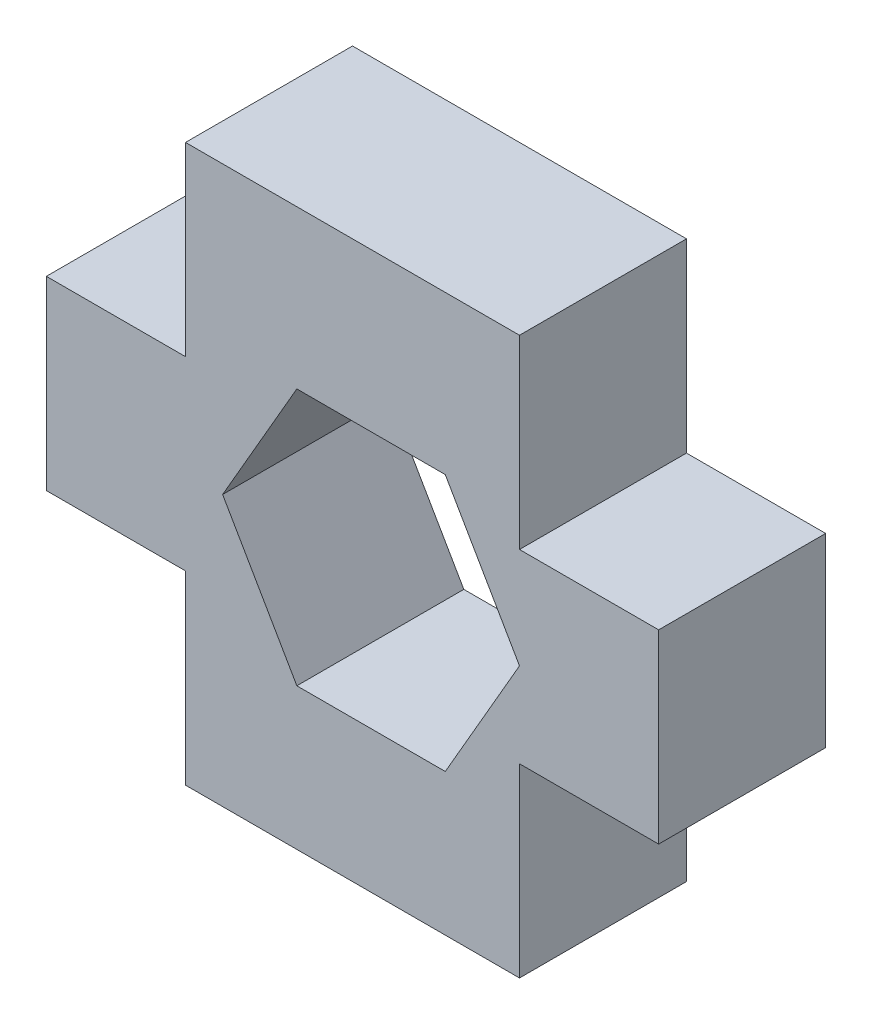
ISO-10303-21;
HEADER;
FILE_DESCRIPTION(('STEP AP214'),'2;1');
FILE_NAME('part.step','',(''),(''),'','','');
FILE_SCHEMA(('AUTOMOTIVE_DESIGN { 1 0 10303 214 1 1 1 1 }'));
ENDSEC;
DATA;
#1=APPLICATION_CONTEXT('core data for automotive mechanical design processes');
#2=APPLICATION_PROTOCOL_DEFINITION('international standard','automotive_design',2000,#1);
#3=PRODUCT_CONTEXT('',#1,'mechanical');
#4=PRODUCT('Part','Part','',(#3));
#5=PRODUCT_RELATED_PRODUCT_CATEGORY('part','',(#4));
#6=PRODUCT_DEFINITION_FORMATION('','',#4);
#7=PRODUCT_DEFINITION_CONTEXT('part definition',#1,'design');
#8=PRODUCT_DEFINITION('design','',#6,#7);
#9=PRODUCT_DEFINITION_SHAPE('','',#8);
#10=(LENGTH_UNIT() NAMED_UNIT(*) SI_UNIT(.MILLI.,.METRE.));
#11=(NAMED_UNIT(*) PLANE_ANGLE_UNIT() SI_UNIT($,.RADIAN.));
#12=(NAMED_UNIT(*) SI_UNIT($,.STERADIAN.) SOLID_ANGLE_UNIT());
#13=UNCERTAINTY_MEASURE_WITH_UNIT(LENGTH_MEASURE(1.E-05),#10,'distance_accuracy_value','');
#14=(GEOMETRIC_REPRESENTATION_CONTEXT(3) GLOBAL_UNCERTAINTY_ASSIGNED_CONTEXT((#13)) GLOBAL_UNIT_ASSIGNED_CONTEXT((#10,
#11,#12)) REPRESENTATION_CONTEXT('',''));
#15=CARTESIAN_POINT('',(0.,0.,0.));
#16=DIRECTION('',(0.,0.,1.));
#17=DIRECTION('',(1.,0.,0.));
#18=AXIS2_PLACEMENT_3D('',#15,#16,#17);
#19=CARTESIAN_POINT('',(0.,0.,3.6));
#20=DIRECTION('',(0.,0.,1.));
#21=DIRECTION('',(1.,0.,0.));
#22=AXIS2_PLACEMENT_3D('',#19,#20,#21);
#23=PLANE('',#22);
#24=DIRECTION('',(0.,-1.,0.));
#25=VECTOR('',#24,1.);
#26=CARTESIAN_POINT('',(0.,4.,3.6));
#27=LINE('',#26,#25);
#28=CARTESIAN_POINT('',(0.,4.,3.6));
#29=VERTEX_POINT('',#28);
#30=CARTESIAN_POINT('',(0.,0.,3.6));
#31=VERTEX_POINT('',#30);
#32=EDGE_CURVE('E208',#29,#31,#27,.T.);
#33=ORIENTED_EDGE('',*,*,#32,.T.);
#34=DIRECTION('',(1.,0.,0.));
#35=VECTOR('',#34,1.);
#36=CARTESIAN_POINT('',(0.,0.,3.6));
#37=LINE('',#36,#35);
#38=CARTESIAN_POINT('',(7.2,0.,3.6));
#39=VERTEX_POINT('',#38);
#40=EDGE_CURVE('E211',#31,#39,#37,.T.);
#41=ORIENTED_EDGE('',*,*,#40,.T.);
#42=DIRECTION('',(0.,1.,0.));
#43=VECTOR('',#42,1.);
#44=CARTESIAN_POINT('',(7.2,0.,3.6));
#45=LINE('',#44,#43);
#46=CARTESIAN_POINT('',(7.2,4.,3.6));
#47=VERTEX_POINT('',#46);
#48=EDGE_CURVE('E214',#39,#47,#45,.T.);
#49=ORIENTED_EDGE('',*,*,#48,.T.);
#50=DIRECTION('',(1.,0.,0.));
#51=VECTOR('',#50,1.);
#52=CARTESIAN_POINT('',(7.2,4.,3.6));
#53=LINE('',#52,#51);
#54=CARTESIAN_POINT('',(10.2,4.,3.6));
#55=VERTEX_POINT('',#54);
#56=EDGE_CURVE('E216',#47,#55,#53,.T.);
#57=ORIENTED_EDGE('',*,*,#56,.T.);
#58=DIRECTION('',(0.,1.,0.));
#59=VECTOR('',#58,1.);
#60=CARTESIAN_POINT('',(10.2,4.,3.6));
#61=LINE('',#60,#59);
#62=CARTESIAN_POINT('',(10.2,8.,3.6));
#63=VERTEX_POINT('',#62);
#64=EDGE_CURVE('E218',#55,#63,#61,.T.);
#65=ORIENTED_EDGE('',*,*,#64,.T.);
#66=DIRECTION('',(-1.,0.,0.));
#67=VECTOR('',#66,1.);
#68=CARTESIAN_POINT('',(7.2,8.,3.6));
#69=LINE('',#68,#67);
#70=CARTESIAN_POINT('',(7.2,8.,3.6));
#71=VERTEX_POINT('',#70);
#72=EDGE_CURVE('E220',#63,#71,#69,.T.);
#73=ORIENTED_EDGE('',*,*,#72,.T.);
#74=DIRECTION('',(0.,1.,0.));
#75=VECTOR('',#74,1.);
#76=CARTESIAN_POINT('',(7.2,8.,3.6));
#77=LINE('',#76,#75);
#78=CARTESIAN_POINT('',(7.2,12.,3.6));
#79=VERTEX_POINT('',#78);
#80=EDGE_CURVE('E222',#71,#79,#77,.T.);
#81=ORIENTED_EDGE('',*,*,#80,.T.);
#82=DIRECTION('',(-1.,0.,0.));
#83=VECTOR('',#82,1.);
#84=CARTESIAN_POINT('',(7.2,12.,3.6));
#85=LINE('',#84,#83);
#86=CARTESIAN_POINT('',(0.,12.,3.6));
#87=VERTEX_POINT('',#86);
#88=EDGE_CURVE('E224',#79,#87,#85,.T.);
#89=ORIENTED_EDGE('',*,*,#88,.T.);
#90=DIRECTION('',(0.,-1.,0.));
#91=VECTOR('',#90,1.);
#92=CARTESIAN_POINT('',(0.,12.,3.6));
#93=LINE('',#92,#91);
#94=CARTESIAN_POINT('',(0.,8.,3.6));
#95=VERTEX_POINT('',#94);
#96=EDGE_CURVE('E226',#87,#95,#93,.T.);
#97=ORIENTED_EDGE('',*,*,#96,.T.);
#98=DIRECTION('',(-1.,0.,0.));
#99=VECTOR('',#98,1.);
#100=CARTESIAN_POINT('',(0.,8.,3.6));
#101=LINE('',#100,#99);
#102=CARTESIAN_POINT('',(-3.,8.,3.6));
#103=VERTEX_POINT('',#102);
#104=EDGE_CURVE('E228',#95,#103,#101,.T.);
#105=ORIENTED_EDGE('',*,*,#104,.T.);
#106=DIRECTION('',(0.,-1.,0.));
#107=VECTOR('',#106,1.);
#108=CARTESIAN_POINT('',(-3.,8.,3.6));
#109=LINE('',#108,#107);
#110=CARTESIAN_POINT('',(-3.,4.,3.6));
#111=VERTEX_POINT('',#110);
#112=EDGE_CURVE('E230',#103,#111,#109,.T.);
#113=ORIENTED_EDGE('',*,*,#112,.T.);
#114=DIRECTION('',(1.,0.,0.));
#115=VECTOR('',#114,1.);
#116=CARTESIAN_POINT('',(-3.,4.,3.6));
#117=LINE('',#116,#115);
#118=EDGE_CURVE('E232',#111,#29,#117,.T.);
#119=ORIENTED_EDGE('',*,*,#118,.T.);
#120=EDGE_LOOP('',(#33,#41,#49,#57,#65,#73,#81,#89,#97,#105,#113,#119));
#121=FACE_BOUND('',#120,.T.);
#122=DIRECTION('',(-0.499999999999999,0.86602540378444,0.));
#123=VECTOR('',#122,1.);
#124=CARTESIAN_POINT('',(7.2,5.82679491924311,3.6));
#125=LINE('',#124,#123);
#126=CARTESIAN_POINT('',(7.2,5.82679491924311,3.6));
#127=VERTEX_POINT('',#126);
#128=CARTESIAN_POINT('',(5.6,8.59807621135332,3.6));
#129=VERTEX_POINT('',#128);
#130=EDGE_CURVE('E165',#127,#129,#125,.T.);
#131=ORIENTED_EDGE('',*,*,#130,.F.);
#132=DIRECTION('',(0.499999999999999,0.866025403784439,0.));
#133=VECTOR('',#132,1.);
#134=CARTESIAN_POINT('',(5.6,3.0555136271329,3.6));
#135=LINE('',#134,#133);
#136=CARTESIAN_POINT('',(5.6,3.0555136271329,3.6));
#137=VERTEX_POINT('',#136);
#138=EDGE_CURVE('E157',#137,#127,#135,.T.);
#139=ORIENTED_EDGE('',*,*,#138,.F.);
#140=DIRECTION('',(1.,0.,0.));
#141=VECTOR('',#140,1.);
#142=CARTESIAN_POINT('',(2.4,3.0555136271329,3.6));
#143=LINE('',#142,#141);
#144=CARTESIAN_POINT('',(2.4,3.0555136271329,3.6));
#145=VERTEX_POINT('',#144);
#146=EDGE_CURVE('E186',#145,#137,#143,.T.);
#147=ORIENTED_EDGE('',*,*,#146,.F.);
#148=DIRECTION('',(0.499999999999999,-0.866025403784439,0.));
#149=VECTOR('',#148,1.);
#150=CARTESIAN_POINT('',(0.800000000000002,5.82679491924311,3.6));
#151=LINE('',#150,#149);
#152=CARTESIAN_POINT('',(0.800000000000002,5.82679491924311,3.6));
#153=VERTEX_POINT('',#152);
#154=EDGE_CURVE('E184',#153,#145,#151,.T.);
#155=ORIENTED_EDGE('',*,*,#154,.F.);
#156=DIRECTION('',(-0.499999999999999,-0.866025403784439,0.));
#157=VECTOR('',#156,1.);
#158=CARTESIAN_POINT('',(2.4,8.59807621135331,3.6));
#159=LINE('',#158,#157);
#160=CARTESIAN_POINT('',(2.4,8.59807621135331,3.6));
#161=VERTEX_POINT('',#160);
#162=EDGE_CURVE('E180',#161,#153,#159,.T.);
#163=ORIENTED_EDGE('',*,*,#162,.F.);
#164=DIRECTION('',(-1.,0.,0.));
#165=VECTOR('',#164,1.);
#166=CARTESIAN_POINT('',(5.6,8.59807621135332,3.6));
#167=LINE('',#166,#165);
#168=EDGE_CURVE('E178',#129,#161,#167,.T.);
#169=ORIENTED_EDGE('',*,*,#168,.F.);
#170=EDGE_LOOP('',(#131,#139,#147,#155,#163,#169));
#171=FACE_BOUND('',#170,.T.);
#172=ADVANCED_FACE('F32',(#121,#171),#23,.T.);
#173=CARTESIAN_POINT('',(0.,0.,0.));
#174=DIRECTION('',(0.,0.,1.));
#175=DIRECTION('',(1.,0.,0.));
#176=AXIS2_PLACEMENT_3D('',#173,#174,#175);
#177=PLANE('',#176);
#178=DIRECTION('',(0.,-1.,0.));
#179=VECTOR('',#178,1.);
#180=CARTESIAN_POINT('',(0.,4.,0.));
#181=LINE('',#180,#179);
#182=CARTESIAN_POINT('',(0.,4.,0.));
#183=VERTEX_POINT('',#182);
#184=CARTESIAN_POINT('',(0.,0.,0.));
#185=VERTEX_POINT('',#184);
#186=EDGE_CURVE('E173',#183,#185,#181,.T.);
#187=ORIENTED_EDGE('',*,*,#186,.F.);
#188=DIRECTION('',(1.,0.,0.));
#189=VECTOR('',#188,1.);
#190=CARTESIAN_POINT('',(-3.,4.,0.));
#191=LINE('',#190,#189);
#192=CARTESIAN_POINT('',(-3.,4.,0.));
#193=VERTEX_POINT('',#192);
#194=EDGE_CURVE('E212',#193,#183,#191,.T.);
#195=ORIENTED_EDGE('',*,*,#194,.F.);
#196=DIRECTION('',(0.,-1.,0.));
#197=VECTOR('',#196,1.);
#198=CARTESIAN_POINT('',(-3.,8.,0.));
#199=LINE('',#198,#197);
#200=CARTESIAN_POINT('',(-3.,8.,0.));
#201=VERTEX_POINT('',#200);
#202=EDGE_CURVE('E255',#201,#193,#199,.T.);
#203=ORIENTED_EDGE('',*,*,#202,.F.);
#204=DIRECTION('',(-1.,0.,0.));
#205=VECTOR('',#204,1.);
#206=CARTESIAN_POINT('',(0.,8.,0.));
#207=LINE('',#206,#205);
#208=CARTESIAN_POINT('',(0.,8.,0.));
#209=VERTEX_POINT('',#208);
#210=EDGE_CURVE('E253',#209,#201,#207,.T.);
#211=ORIENTED_EDGE('',*,*,#210,.F.);
#212=DIRECTION('',(0.,-1.,0.));
#213=VECTOR('',#212,1.);
#214=CARTESIAN_POINT('',(0.,12.,0.));
#215=LINE('',#214,#213);
#216=CARTESIAN_POINT('',(0.,12.,0.));
#217=VERTEX_POINT('',#216);
#218=EDGE_CURVE('E251',#217,#209,#215,.T.);
#219=ORIENTED_EDGE('',*,*,#218,.F.);
#220=DIRECTION('',(-1.,0.,0.));
#221=VECTOR('',#220,1.);
#222=CARTESIAN_POINT('',(7.2,12.,0.));
#223=LINE('',#222,#221);
#224=CARTESIAN_POINT('',(7.2,12.,0.));
#225=VERTEX_POINT('',#224);
#226=EDGE_CURVE('E249',#225,#217,#223,.T.);
#227=ORIENTED_EDGE('',*,*,#226,.F.);
#228=DIRECTION('',(0.,1.,0.));
#229=VECTOR('',#228,1.);
#230=CARTESIAN_POINT('',(7.2,8.,0.));
#231=LINE('',#230,#229);
#232=CARTESIAN_POINT('',(7.2,8.,0.));
#233=VERTEX_POINT('',#232);
#234=EDGE_CURVE('E247',#233,#225,#231,.T.);
#235=ORIENTED_EDGE('',*,*,#234,.F.);
#236=DIRECTION('',(-1.,0.,0.));
#237=VECTOR('',#236,1.);
#238=CARTESIAN_POINT('',(7.2,8.,0.));
#239=LINE('',#238,#237);
#240=CARTESIAN_POINT('',(10.2,8.,0.));
#241=VERTEX_POINT('',#240);
#242=EDGE_CURVE('E245',#241,#233,#239,.T.);
#243=ORIENTED_EDGE('',*,*,#242,.F.);
#244=DIRECTION('',(0.,1.,0.));
#245=VECTOR('',#244,1.);
#246=CARTESIAN_POINT('',(10.2,4.,0.));
#247=LINE('',#246,#245);
#248=CARTESIAN_POINT('',(10.2,4.,0.));
#249=VERTEX_POINT('',#248);
#250=EDGE_CURVE('E243',#249,#241,#247,.T.);
#251=ORIENTED_EDGE('',*,*,#250,.F.);
#252=DIRECTION('',(1.,0.,0.));
#253=VECTOR('',#252,1.);
#254=CARTESIAN_POINT('',(7.2,4.,0.));
#255=LINE('',#254,#253);
#256=CARTESIAN_POINT('',(7.2,4.,0.));
#257=VERTEX_POINT('',#256);
#258=EDGE_CURVE('E241',#257,#249,#255,.T.);
#259=ORIENTED_EDGE('',*,*,#258,.F.);
#260=DIRECTION('',(0.,1.,0.));
#261=VECTOR('',#260,1.);
#262=CARTESIAN_POINT('',(7.2,0.,0.));
#263=LINE('',#262,#261);
#264=CARTESIAN_POINT('',(7.2,0.,0.));
#265=VERTEX_POINT('',#264);
#266=EDGE_CURVE('E239',#265,#257,#263,.T.);
#267=ORIENTED_EDGE('',*,*,#266,.F.);
#268=DIRECTION('',(1.,0.,0.));
#269=VECTOR('',#268,1.);
#270=CARTESIAN_POINT('',(0.,0.,0.));
#271=LINE('',#270,#269);
#272=EDGE_CURVE('E237',#185,#265,#271,.T.);
#273=ORIENTED_EDGE('',*,*,#272,.F.);
#274=EDGE_LOOP('',(#187,#195,#203,#211,#219,#227,#235,#243,#251,#259,#267,#273));
#275=FACE_BOUND('',#274,.T.);
#276=DIRECTION('',(0.499999999999999,0.866025403784439,0.));
#277=VECTOR('',#276,1.);
#278=CARTESIAN_POINT('',(5.6,3.0555136271329,0.));
#279=LINE('',#278,#277);
#280=CARTESIAN_POINT('',(5.6,3.0555136271329,0.));
#281=VERTEX_POINT('',#280);
#282=CARTESIAN_POINT('',(7.2,5.82679491924311,0.));
#283=VERTEX_POINT('',#282);
#284=EDGE_CURVE('E55',#281,#283,#279,.T.);
#285=ORIENTED_EDGE('',*,*,#284,.T.);
#286=DIRECTION('',(-0.499999999999999,0.86602540378444,0.));
#287=VECTOR('',#286,1.);
#288=CARTESIAN_POINT('',(7.2,5.82679491924311,0.));
#289=LINE('',#288,#287);
#290=CARTESIAN_POINT('',(5.6,8.59807621135332,0.));
#291=VERTEX_POINT('',#290);
#292=EDGE_CURVE('E172',#283,#291,#289,.T.);
#293=ORIENTED_EDGE('',*,*,#292,.T.);
#294=DIRECTION('',(-1.,0.,0.));
#295=VECTOR('',#294,1.);
#296=CARTESIAN_POINT('',(5.6,8.59807621135332,0.));
#297=LINE('',#296,#295);
#298=CARTESIAN_POINT('',(2.4,8.59807621135331,0.));
#299=VERTEX_POINT('',#298);
#300=EDGE_CURVE('E190',#291,#299,#297,.T.);
#301=ORIENTED_EDGE('',*,*,#300,.T.);
#302=DIRECTION('',(-0.499999999999999,-0.866025403784439,0.));
#303=VECTOR('',#302,1.);
#304=CARTESIAN_POINT('',(2.4,8.59807621135331,0.));
#305=LINE('',#304,#303);
#306=CARTESIAN_POINT('',(0.800000000000002,5.82679491924311,0.));
#307=VERTEX_POINT('',#306);
#308=EDGE_CURVE('E193',#299,#307,#305,.T.);
#309=ORIENTED_EDGE('',*,*,#308,.T.);
#310=DIRECTION('',(0.499999999999999,-0.866025403784439,0.));
#311=VECTOR('',#310,1.);
#312=CARTESIAN_POINT('',(0.800000000000002,5.82679491924311,0.));
#313=LINE('',#312,#311);
#314=CARTESIAN_POINT('',(2.4,3.0555136271329,0.));
#315=VERTEX_POINT('',#314);
#316=EDGE_CURVE('E196',#307,#315,#313,.T.);
#317=ORIENTED_EDGE('',*,*,#316,.T.);
#318=DIRECTION('',(1.,0.,0.));
#319=VECTOR('',#318,1.);
#320=CARTESIAN_POINT('',(2.4,3.0555136271329,0.));
#321=LINE('',#320,#319);
#322=EDGE_CURVE('E166',#315,#281,#321,.T.);
#323=ORIENTED_EDGE('',*,*,#322,.T.);
#324=EDGE_LOOP('',(#285,#293,#301,#309,#317,#323));
#325=FACE_BOUND('',#324,.T.);
#326=ADVANCED_FACE('F297',(#275,#325),#177,.F.);
#327=CARTESIAN_POINT('',(0.,4.,3.6));
#328=DIRECTION('',(1.,0.,0.));
#329=DIRECTION('',(0.,0.,-1.));
#330=AXIS2_PLACEMENT_3D('',#327,#328,#329);
#331=PLANE('',#330);
#332=ORIENTED_EDGE('',*,*,#186,.T.);
#333=DIRECTION('',(0.,0.,-1.));
#334=VECTOR('',#333,1.);
#335=CARTESIAN_POINT('',(0.,0.,3.6));
#336=LINE('',#335,#334);
#337=EDGE_CURVE('E11',#31,#185,#336,.T.);
#338=ORIENTED_EDGE('',*,*,#337,.F.);
#339=ORIENTED_EDGE('',*,*,#32,.F.);
#340=DIRECTION('',(0.,0.,-1.));
#341=VECTOR('',#340,1.);
#342=CARTESIAN_POINT('',(0.,4.,3.6));
#343=LINE('',#342,#341);
#344=EDGE_CURVE('E234',#29,#183,#343,.T.);
#345=ORIENTED_EDGE('',*,*,#344,.T.);
#346=EDGE_LOOP('',(#332,#338,#339,#345));
#347=FACE_BOUND('',#346,.T.);
#348=ADVANCED_FACE('F34',(#347),#331,.F.);
#349=CARTESIAN_POINT('',(0.,0.,3.6));
#350=DIRECTION('',(0.,1.,0.));
#351=DIRECTION('',(0.,0.,1.));
#352=AXIS2_PLACEMENT_3D('',#349,#350,#351);
#353=PLANE('',#352);
#354=ORIENTED_EDGE('',*,*,#272,.T.);
#355=DIRECTION('',(0.,0.,-1.));
#356=VECTOR('',#355,1.);
#357=CARTESIAN_POINT('',(7.2,0.,3.6));
#358=LINE('',#357,#356);
#359=EDGE_CURVE('E40',#39,#265,#358,.T.);
#360=ORIENTED_EDGE('',*,*,#359,.F.);
#361=ORIENTED_EDGE('',*,*,#40,.F.);
#362=ORIENTED_EDGE('',*,*,#337,.T.);
#363=EDGE_LOOP('',(#354,#360,#361,#362));
#364=FACE_BOUND('',#363,.T.);
#365=ADVANCED_FACE('F314',(#364),#353,.F.);
#366=CARTESIAN_POINT('',(7.2,0.,3.6));
#367=DIRECTION('',(-1.,0.,0.));
#368=DIRECTION('',(0.,0.,1.));
#369=AXIS2_PLACEMENT_3D('',#366,#367,#368);
#370=PLANE('',#369);
#371=ORIENTED_EDGE('',*,*,#266,.T.);
#372=DIRECTION('',(0.,0.,-1.));
#373=VECTOR('',#372,1.);
#374=CARTESIAN_POINT('',(7.2,4.,3.6));
#375=LINE('',#374,#373);
#376=EDGE_CURVE('E284',#47,#257,#375,.T.);
#377=ORIENTED_EDGE('',*,*,#376,.F.);
#378=ORIENTED_EDGE('',*,*,#48,.F.);
#379=ORIENTED_EDGE('',*,*,#359,.T.);
#380=EDGE_LOOP('',(#371,#377,#378,#379));
#381=FACE_BOUND('',#380,.T.);
#382=ADVANCED_FACE('F291',(#381),#370,.F.);
#383=CARTESIAN_POINT('',(7.2,4.,3.6));
#384=DIRECTION('',(0.,1.,0.));
#385=DIRECTION('',(-1.,0.,0.));
#386=AXIS2_PLACEMENT_3D('',#383,#384,#385);
#387=PLANE('',#386);
#388=ORIENTED_EDGE('',*,*,#258,.T.);
#389=DIRECTION('',(0.,0.,-1.));
#390=VECTOR('',#389,1.);
#391=CARTESIAN_POINT('',(10.2,4.,3.6));
#392=LINE('',#391,#390);
#393=EDGE_CURVE('E281',#55,#249,#392,.T.);
#394=ORIENTED_EDGE('',*,*,#393,.F.);
#395=ORIENTED_EDGE('',*,*,#56,.F.);
#396=ORIENTED_EDGE('',*,*,#376,.T.);
#397=EDGE_LOOP('',(#388,#394,#395,#396));
#398=FACE_BOUND('',#397,.T.);
#399=ADVANCED_FACE('F303',(#398),#387,.F.);
#400=CARTESIAN_POINT('',(10.2,4.,3.6));
#401=DIRECTION('',(-1.,0.,0.));
#402=DIRECTION('',(0.,0.,1.));
#403=AXIS2_PLACEMENT_3D('',#400,#401,#402);
#404=PLANE('',#403);
#405=ORIENTED_EDGE('',*,*,#250,.T.);
#406=DIRECTION('',(0.,0.,-1.));
#407=VECTOR('',#406,1.);
#408=CARTESIAN_POINT('',(10.2,8.,3.6));
#409=LINE('',#408,#407);
#410=EDGE_CURVE('E278',#63,#241,#409,.T.);
#411=ORIENTED_EDGE('',*,*,#410,.F.);
#412=ORIENTED_EDGE('',*,*,#64,.F.);
#413=ORIENTED_EDGE('',*,*,#393,.T.);
#414=EDGE_LOOP('',(#405,#411,#412,#413));
#415=FACE_BOUND('',#414,.T.);
#416=ADVANCED_FACE('F307',(#415),#404,.F.);
#417=CARTESIAN_POINT('',(7.2,8.,3.6));
#418=DIRECTION('',(0.,-1.,0.));
#419=DIRECTION('',(0.,0.,-1.));
#420=AXIS2_PLACEMENT_3D('',#417,#418,#419);
#421=PLANE('',#420);
#422=ORIENTED_EDGE('',*,*,#242,.T.);
#423=DIRECTION('',(0.,0.,-1.));
#424=VECTOR('',#423,1.);
#425=CARTESIAN_POINT('',(7.2,8.,3.6));
#426=LINE('',#425,#424);
#427=EDGE_CURVE('E275',#71,#233,#426,.T.);
#428=ORIENTED_EDGE('',*,*,#427,.F.);
#429=ORIENTED_EDGE('',*,*,#72,.F.);
#430=ORIENTED_EDGE('',*,*,#410,.T.);
#431=EDGE_LOOP('',(#422,#428,#429,#430));
#432=FACE_BOUND('',#431,.T.);
#433=ADVANCED_FACE('F347',(#432),#421,.F.);
#434=CARTESIAN_POINT('',(7.2,8.,3.6));
#435=DIRECTION('',(-1.,0.,0.));
#436=DIRECTION('',(0.,0.,1.));
#437=AXIS2_PLACEMENT_3D('',#434,#435,#436);
#438=PLANE('',#437);
#439=ORIENTED_EDGE('',*,*,#234,.T.);
#440=DIRECTION('',(0.,0.,-1.));
#441=VECTOR('',#440,1.);
#442=CARTESIAN_POINT('',(7.2,12.,3.6));
#443=LINE('',#442,#441);
#444=EDGE_CURVE('E272',#79,#225,#443,.T.);
#445=ORIENTED_EDGE('',*,*,#444,.F.);
#446=ORIENTED_EDGE('',*,*,#80,.F.);
#447=ORIENTED_EDGE('',*,*,#427,.T.);
#448=EDGE_LOOP('',(#439,#445,#446,#447));
#449=FACE_BOUND('',#448,.T.);
#450=ADVANCED_FACE('F345',(#449),#438,.F.);
#451=CARTESIAN_POINT('',(7.2,12.,3.6));
#452=DIRECTION('',(0.,-1.,0.));
#453=DIRECTION('',(1.,0.,0.));
#454=AXIS2_PLACEMENT_3D('',#451,#452,#453);
#455=PLANE('',#454);
#456=ORIENTED_EDGE('',*,*,#226,.T.);
#457=DIRECTION('',(0.,0.,-1.));
#458=VECTOR('',#457,1.);
#459=CARTESIAN_POINT('',(0.,12.,3.6));
#460=LINE('',#459,#458);
#461=EDGE_CURVE('E269',#87,#217,#460,.T.);
#462=ORIENTED_EDGE('',*,*,#461,.F.);
#463=ORIENTED_EDGE('',*,*,#88,.F.);
#464=ORIENTED_EDGE('',*,*,#444,.T.);
#465=EDGE_LOOP('',(#456,#462,#463,#464));
#466=FACE_BOUND('',#465,.T.);
#467=ADVANCED_FACE('F341',(#466),#455,.F.);
#468=CARTESIAN_POINT('',(0.,12.,3.6));
#469=DIRECTION('',(1.,0.,0.));
#470=DIRECTION('',(0.,0.,-1.));
#471=AXIS2_PLACEMENT_3D('',#468,#469,#470);
#472=PLANE('',#471);
#473=ORIENTED_EDGE('',*,*,#218,.T.);
#474=DIRECTION('',(0.,0.,-1.));
#475=VECTOR('',#474,1.);
#476=CARTESIAN_POINT('',(0.,8.,3.6));
#477=LINE('',#476,#475);
#478=EDGE_CURVE('E266',#95,#209,#477,.T.);
#479=ORIENTED_EDGE('',*,*,#478,.F.);
#480=ORIENTED_EDGE('',*,*,#96,.F.);
#481=ORIENTED_EDGE('',*,*,#461,.T.);
#482=EDGE_LOOP('',(#473,#479,#480,#481));
#483=FACE_BOUND('',#482,.T.);
#484=ADVANCED_FACE('F336',(#483),#472,.F.);
#485=CARTESIAN_POINT('',(0.,8.,3.6));
#486=DIRECTION('',(0.,-1.,0.));
#487=DIRECTION('',(0.,0.,-1.));
#488=AXIS2_PLACEMENT_3D('',#485,#486,#487);
#489=PLANE('',#488);
#490=ORIENTED_EDGE('',*,*,#210,.T.);
#491=DIRECTION('',(0.,0.,-1.));
#492=VECTOR('',#491,1.);
#493=CARTESIAN_POINT('',(-3.,8.,3.6));
#494=LINE('',#493,#492);
#495=EDGE_CURVE('E263',#103,#201,#494,.T.);
#496=ORIENTED_EDGE('',*,*,#495,.F.);
#497=ORIENTED_EDGE('',*,*,#104,.F.);
#498=ORIENTED_EDGE('',*,*,#478,.T.);
#499=EDGE_LOOP('',(#490,#496,#497,#498));
#500=FACE_BOUND('',#499,.T.);
#501=ADVANCED_FACE('F330',(#500),#489,.F.);
#502=CARTESIAN_POINT('',(-3.,8.,3.6));
#503=DIRECTION('',(1.,0.,0.));
#504=DIRECTION('',(0.,0.,-1.));
#505=AXIS2_PLACEMENT_3D('',#502,#503,#504);
#506=PLANE('',#505);
#507=ORIENTED_EDGE('',*,*,#202,.T.);
#508=DIRECTION('',(0.,0.,-1.));
#509=VECTOR('',#508,1.);
#510=CARTESIAN_POINT('',(-3.,4.,3.6));
#511=LINE('',#510,#509);
#512=EDGE_CURVE('E260',#111,#193,#511,.T.);
#513=ORIENTED_EDGE('',*,*,#512,.F.);
#514=ORIENTED_EDGE('',*,*,#112,.F.);
#515=ORIENTED_EDGE('',*,*,#495,.T.);
#516=EDGE_LOOP('',(#507,#513,#514,#515));
#517=FACE_BOUND('',#516,.T.);
#518=ADVANCED_FACE('F326',(#517),#506,.F.);
#519=CARTESIAN_POINT('',(-3.,4.,3.6));
#520=DIRECTION('',(0.,1.,0.));
#521=DIRECTION('',(0.,0.,1.));
#522=AXIS2_PLACEMENT_3D('',#519,#520,#521);
#523=PLANE('',#522);
#524=ORIENTED_EDGE('',*,*,#194,.T.);
#525=ORIENTED_EDGE('',*,*,#344,.F.);
#526=ORIENTED_EDGE('',*,*,#118,.F.);
#527=ORIENTED_EDGE('',*,*,#512,.T.);
#528=EDGE_LOOP('',(#524,#525,#526,#527));
#529=FACE_BOUND('',#528,.T.);
#530=ADVANCED_FACE('F321',(#529),#523,.F.);
#531=CARTESIAN_POINT('',(5.6,3.0555136271329,3.6));
#532=DIRECTION('',(-0.866025403784439,0.499999999999999,0.));
#533=DIRECTION('',(-0.499999999999999,-0.866025403784439,0.));
#534=AXIS2_PLACEMENT_3D('',#531,#532,#533);
#535=PLANE('',#534);
#536=ORIENTED_EDGE('',*,*,#284,.F.);
#537=DIRECTION('',(0.,0.,-1.));
#538=VECTOR('',#537,1.);
#539=CARTESIAN_POINT('',(5.6,3.0555136271329,3.6));
#540=LINE('',#539,#538);
#541=EDGE_CURVE('E161',#137,#281,#540,.T.);
#542=ORIENTED_EDGE('',*,*,#541,.F.);
#543=ORIENTED_EDGE('',*,*,#138,.T.);
#544=DIRECTION('',(0.,0.,-1.));
#545=VECTOR('',#544,1.);
#546=CARTESIAN_POINT('',(7.2,5.82679491924311,3.6));
#547=LINE('',#546,#545);
#548=EDGE_CURVE('E160',#127,#283,#547,.T.);
#549=ORIENTED_EDGE('',*,*,#548,.T.);
#550=EDGE_LOOP('',(#536,#542,#543,#549));
#551=FACE_BOUND('',#550,.T.);
#552=ADVANCED_FACE('F159',(#551),#535,.T.);
#553=CARTESIAN_POINT('',(7.2,5.82679491924311,3.6));
#554=DIRECTION('',(-0.866025403784439,-0.499999999999999,0.));
#555=DIRECTION('',(0.499999999999999,-0.866025403784439,0.));
#556=AXIS2_PLACEMENT_3D('',#553,#554,#555);
#557=PLANE('',#556);
#558=ORIENTED_EDGE('',*,*,#292,.F.);
#559=ORIENTED_EDGE('',*,*,#548,.F.);
#560=ORIENTED_EDGE('',*,*,#130,.T.);
#561=DIRECTION('',(0.,0.,-1.));
#562=VECTOR('',#561,1.);
#563=CARTESIAN_POINT('',(5.6,8.59807621135332,3.6));
#564=LINE('',#563,#562);
#565=EDGE_CURVE('E174',#129,#291,#564,.T.);
#566=ORIENTED_EDGE('',*,*,#565,.T.);
#567=EDGE_LOOP('',(#558,#559,#560,#566));
#568=FACE_BOUND('',#567,.T.);
#569=ADVANCED_FACE('F169',(#568),#557,.T.);
#570=CARTESIAN_POINT('',(5.6,8.59807621135332,3.6));
#571=DIRECTION('',(0.,-1.,0.));
#572=DIRECTION('',(1.,0.,0.));
#573=AXIS2_PLACEMENT_3D('',#570,#571,#572);
#574=PLANE('',#573);
#575=ORIENTED_EDGE('',*,*,#300,.F.);
#576=ORIENTED_EDGE('',*,*,#565,.F.);
#577=ORIENTED_EDGE('',*,*,#168,.T.);
#578=DIRECTION('',(0.,0.,-1.));
#579=VECTOR('',#578,1.);
#580=CARTESIAN_POINT('',(2.4,8.59807621135331,3.6));
#581=LINE('',#580,#579);
#582=EDGE_CURVE('E205',#161,#299,#581,.T.);
#583=ORIENTED_EDGE('',*,*,#582,.T.);
#584=EDGE_LOOP('',(#575,#576,#577,#583));
#585=FACE_BOUND('',#584,.T.);
#586=ADVANCED_FACE('F405',(#585),#574,.T.);
#587=CARTESIAN_POINT('',(2.4,8.59807621135331,3.6));
#588=DIRECTION('',(0.866025403784439,-0.499999999999999,0.));
#589=DIRECTION('',(0.499999999999999,0.866025403784439,0.));
#590=AXIS2_PLACEMENT_3D('',#587,#588,#589);
#591=PLANE('',#590);
#592=ORIENTED_EDGE('',*,*,#308,.F.);
#593=ORIENTED_EDGE('',*,*,#582,.F.);
#594=ORIENTED_EDGE('',*,*,#162,.T.);
#595=DIRECTION('',(0.,0.,-1.));
#596=VECTOR('',#595,1.);
#597=CARTESIAN_POINT('',(0.800000000000002,5.82679491924311,3.6));
#598=LINE('',#597,#596);
#599=EDGE_CURVE('E203',#153,#307,#598,.T.);
#600=ORIENTED_EDGE('',*,*,#599,.T.);
#601=EDGE_LOOP('',(#592,#593,#594,#600));
#602=FACE_BOUND('',#601,.T.);
#603=ADVANCED_FACE('F411',(#602),#591,.T.);
#604=CARTESIAN_POINT('',(0.800000000000002,5.82679491924311,3.6));
#605=DIRECTION('',(0.866025403784439,0.499999999999999,0.));
#606=DIRECTION('',(-0.499999999999999,0.866025403784439,0.));
#607=AXIS2_PLACEMENT_3D('',#604,#605,#606);
#608=PLANE('',#607);
#609=ORIENTED_EDGE('',*,*,#316,.F.);
#610=ORIENTED_EDGE('',*,*,#599,.F.);
#611=ORIENTED_EDGE('',*,*,#154,.T.);
#612=DIRECTION('',(0.,0.,-1.));
#613=VECTOR('',#612,1.);
#614=CARTESIAN_POINT('',(2.4,3.0555136271329,3.6));
#615=LINE('',#614,#613);
#616=EDGE_CURVE('E47',#145,#315,#615,.T.);
#617=ORIENTED_EDGE('',*,*,#616,.T.);
#618=EDGE_LOOP('',(#609,#610,#611,#617));
#619=FACE_BOUND('',#618,.T.);
#620=ADVANCED_FACE('F419',(#619),#608,.T.);
#621=CARTESIAN_POINT('',(2.4,3.0555136271329,3.6));
#622=DIRECTION('',(0.,1.,0.));
#623=DIRECTION('',(0.,0.,1.));
#624=AXIS2_PLACEMENT_3D('',#621,#622,#623);
#625=PLANE('',#624);
#626=ORIENTED_EDGE('',*,*,#322,.F.);
#627=ORIENTED_EDGE('',*,*,#616,.F.);
#628=ORIENTED_EDGE('',*,*,#146,.T.);
#629=ORIENTED_EDGE('',*,*,#541,.T.);
#630=EDGE_LOOP('',(#626,#627,#628,#629));
#631=FACE_BOUND('',#630,.T.);
#632=ADVANCED_FACE('F427',(#631),#625,.T.);
#633=CLOSED_SHELL('',(#172,#326,#348,#365,#382,#399,#416,#433,#450,#467,#484,#501,#518,#530,
#552,#569,#586,#603,#620,#632));
#634=MANIFOLD_SOLID_BREP('B2',#633);
#635=ADVANCED_BREP_SHAPE_REPRESENTATION('',(#18,#634),#14);
#636=SHAPE_DEFINITION_REPRESENTATION(#9,#635);
ENDSEC;
END-ISO-10303-21;
